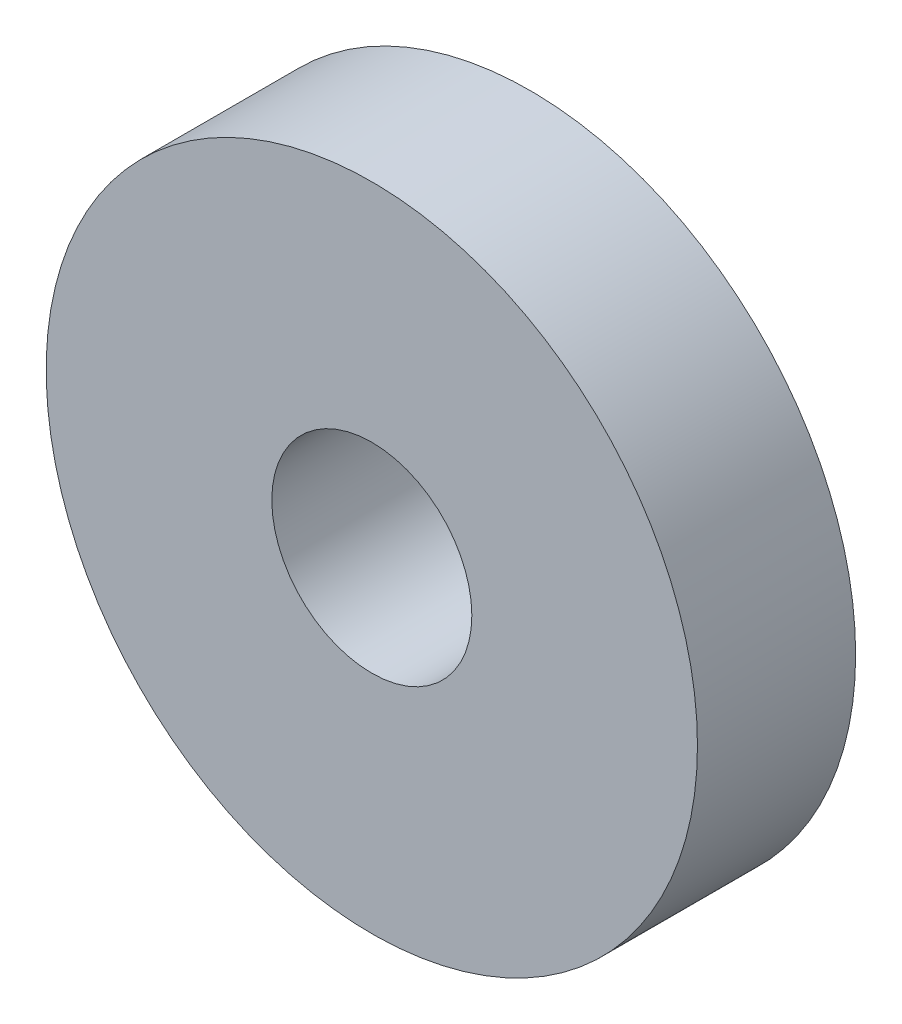
ISO-10303-21;
HEADER;
FILE_DESCRIPTION(('STEP AP214'),'2;1');
FILE_NAME('part.step','',(''),(''),'','','');
FILE_SCHEMA(('AUTOMOTIVE_DESIGN { 1 0 10303 214 1 1 1 1 }'));
ENDSEC;
DATA;
#1=APPLICATION_CONTEXT('core data for automotive mechanical design processes');
#2=APPLICATION_PROTOCOL_DEFINITION('international standard','automotive_design',2000,#1);
#3=PRODUCT_CONTEXT('',#1,'mechanical');
#4=PRODUCT('Part','Part','',(#3));
#5=PRODUCT_RELATED_PRODUCT_CATEGORY('part','',(#4));
#6=PRODUCT_DEFINITION_FORMATION('','',#4);
#7=PRODUCT_DEFINITION_CONTEXT('part definition',#1,'design');
#8=PRODUCT_DEFINITION('design','',#6,#7);
#9=PRODUCT_DEFINITION_SHAPE('','',#8);
#10=(LENGTH_UNIT() NAMED_UNIT(*) SI_UNIT(.MILLI.,.METRE.));
#11=(NAMED_UNIT(*) PLANE_ANGLE_UNIT() SI_UNIT($,.RADIAN.));
#12=(NAMED_UNIT(*) SI_UNIT($,.STERADIAN.) SOLID_ANGLE_UNIT());
#13=UNCERTAINTY_MEASURE_WITH_UNIT(LENGTH_MEASURE(1.E-05),#10,'distance_accuracy_value','');
#14=(GEOMETRIC_REPRESENTATION_CONTEXT(3) GLOBAL_UNCERTAINTY_ASSIGNED_CONTEXT((#13)) GLOBAL_UNIT_ASSIGNED_CONTEXT((#10,
#11,#12)) REPRESENTATION_CONTEXT('',''));
#15=CARTESIAN_POINT('',(0.,0.,0.));
#16=DIRECTION('',(0.,0.,1.));
#17=DIRECTION('',(1.,0.,0.));
#18=AXIS2_PLACEMENT_3D('',#15,#16,#17);
#19=CARTESIAN_POINT('',(0.,0.,3.4));
#20=DIRECTION('',(0.,0.,1.));
#21=DIRECTION('',(1.,0.,0.));
#22=AXIS2_PLACEMENT_3D('',#19,#20,#21);
#23=PLANE('',#22);
#24=CARTESIAN_POINT('',(0.,0.,3.4));
#25=DIRECTION('',(0.,0.,1.));
#26=DIRECTION('',(1.,0.,0.));
#27=AXIS2_PLACEMENT_3D('',#24,#25,#26);
#28=CIRCLE('',#27,7.);
#29=CARTESIAN_POINT('',(7.,0.,3.4));
#30=VERTEX_POINT('',#29);
#31=EDGE_CURVE('E10',#30,#30,#28,.T.);
#32=ORIENTED_EDGE('',*,*,#31,.T.);
#33=EDGE_LOOP('',(#32));
#34=FACE_BOUND('',#33,.T.);
#35=CARTESIAN_POINT('',(0.,0.,3.4));
#36=DIRECTION('',(0.,0.,1.));
#37=DIRECTION('',(1.,0.,0.));
#38=AXIS2_PLACEMENT_3D('',#35,#36,#37);
#39=CIRCLE('',#38,2.15);
#40=CARTESIAN_POINT('',(2.15,0.,3.4));
#41=VERTEX_POINT('',#40);
#42=EDGE_CURVE('E40',#41,#41,#39,.T.);
#43=ORIENTED_EDGE('',*,*,#42,.F.);
#44=EDGE_LOOP('',(#43));
#45=FACE_BOUND('',#44,.T.);
#46=ADVANCED_FACE('F29',(#34,#45),#23,.T.);
#47=CARTESIAN_POINT('',(0.,0.,0.));
#48=DIRECTION('',(0.,0.,1.));
#49=DIRECTION('',(1.,0.,0.));
#50=AXIS2_PLACEMENT_3D('',#47,#48,#49);
#51=PLANE('',#50);
#52=CARTESIAN_POINT('',(0.,0.,0.));
#53=DIRECTION('',(0.,0.,1.));
#54=DIRECTION('',(1.,0.,0.));
#55=AXIS2_PLACEMENT_3D('',#52,#53,#54);
#56=CIRCLE('',#55,7.);
#57=CARTESIAN_POINT('',(7.,0.,0.));
#58=VERTEX_POINT('',#57);
#59=EDGE_CURVE('E33',#58,#58,#56,.T.);
#60=ORIENTED_EDGE('',*,*,#59,.F.);
#61=EDGE_LOOP('',(#60));
#62=FACE_BOUND('',#61,.T.);
#63=CARTESIAN_POINT('',(0.,0.,0.));
#64=DIRECTION('',(0.,0.,1.));
#65=DIRECTION('',(1.,0.,0.));
#66=AXIS2_PLACEMENT_3D('',#63,#64,#65);
#67=CIRCLE('',#66,2.15);
#68=CARTESIAN_POINT('',(2.15,0.,0.));
#69=VERTEX_POINT('',#68);
#70=EDGE_CURVE('E42',#69,#69,#67,.T.);
#71=ORIENTED_EDGE('',*,*,#70,.T.);
#72=EDGE_LOOP('',(#71));
#73=FACE_BOUND('',#72,.T.);
#74=ADVANCED_FACE('F52',(#62,#73),#51,.F.);
#75=CARTESIAN_POINT('',(0.,0.,3.4));
#76=DIRECTION('',(0.,0.,-1.));
#77=DIRECTION('',(-1.,0.,0.));
#78=AXIS2_PLACEMENT_3D('',#75,#76,#77);
#79=CYLINDRICAL_SURFACE('',#78,7.);
#80=ORIENTED_EDGE('',*,*,#31,.F.);
#81=EDGE_LOOP('',(#80));
#82=FACE_BOUND('',#81,.T.);
#83=ORIENTED_EDGE('',*,*,#59,.T.);
#84=EDGE_LOOP('',(#83));
#85=FACE_BOUND('',#84,.T.);
#86=ADVANCED_FACE('F31',(#82,#85),#79,.T.);
#87=CARTESIAN_POINT('',(0.,0.,3.4));
#88=DIRECTION('',(0.,0.,-1.));
#89=DIRECTION('',(-1.,0.,0.));
#90=AXIS2_PLACEMENT_3D('',#87,#88,#89);
#91=CYLINDRICAL_SURFACE('',#90,2.15);
#92=ORIENTED_EDGE('',*,*,#42,.T.);
#93=EDGE_LOOP('',(#92));
#94=FACE_BOUND('',#93,.T.);
#95=ORIENTED_EDGE('',*,*,#70,.F.);
#96=EDGE_LOOP('',(#95));
#97=FACE_BOUND('',#96,.T.);
#98=ADVANCED_FACE('F48',(#94,#97),#91,.F.);
#99=CLOSED_SHELL('',(#46,#74,#86,#98));
#100=MANIFOLD_SOLID_BREP('B2',#99);
#101=ADVANCED_BREP_SHAPE_REPRESENTATION('',(#18,#100),#14);
#102=SHAPE_DEFINITION_REPRESENTATION(#9,#101);
ENDSEC;
END-ISO-10303-21;
